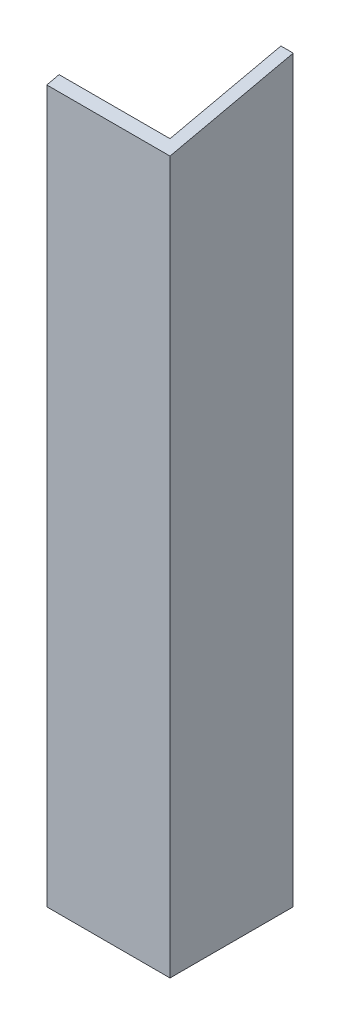
ISO-10303-21;
HEADER;
FILE_DESCRIPTION(('STEP AP214'),'2;1');
FILE_NAME('part.step','',(''),(''),'','','');
FILE_SCHEMA(('AUTOMOTIVE_DESIGN { 1 0 10303 214 1 1 1 1 }'));
ENDSEC;
DATA;
#1=APPLICATION_CONTEXT('core data for automotive mechanical design processes');
#2=APPLICATION_PROTOCOL_DEFINITION('international standard','automotive_design',2000,#1);
#3=PRODUCT_CONTEXT('',#1,'mechanical');
#4=PRODUCT('Part','Part','',(#3));
#5=PRODUCT_RELATED_PRODUCT_CATEGORY('part','',(#4));
#6=PRODUCT_DEFINITION_FORMATION('','',#4);
#7=PRODUCT_DEFINITION_CONTEXT('part definition',#1,'design');
#8=PRODUCT_DEFINITION('design','',#6,#7);
#9=PRODUCT_DEFINITION_SHAPE('','',#8);
#10=(LENGTH_UNIT() NAMED_UNIT(*) SI_UNIT(.MILLI.,.METRE.));
#11=(NAMED_UNIT(*) PLANE_ANGLE_UNIT() SI_UNIT($,.RADIAN.));
#12=(NAMED_UNIT(*) SI_UNIT($,.STERADIAN.) SOLID_ANGLE_UNIT());
#13=UNCERTAINTY_MEASURE_WITH_UNIT(LENGTH_MEASURE(1.E-05),#10,'distance_accuracy_value','');
#14=(GEOMETRIC_REPRESENTATION_CONTEXT(3) GLOBAL_UNCERTAINTY_ASSIGNED_CONTEXT((#13)) GLOBAL_UNIT_ASSIGNED_CONTEXT((#10,
#11,#12)) REPRESENTATION_CONTEXT('',''));
#15=CARTESIAN_POINT('',(0.,0.,0.));
#16=DIRECTION('',(0.,0.,1.));
#17=DIRECTION('',(1.,0.,0.));
#18=AXIS2_PLACEMENT_3D('',#15,#16,#17);
#19=CARTESIAN_POINT('',(-3.22727272727272,4.20454545454545,-20.));
#20=DIRECTION('',(-1.,0.,0.));
#21=DIRECTION('',(0.,-1.,0.));
#22=AXIS2_PLACEMENT_3D('',#19,#20,#21);
#23=PLANE('',#22);
#24=DIRECTION('',(0.,-1.,0.));
#25=VECTOR('',#24,1.);
#26=CARTESIAN_POINT('',(-3.22727272727271,4.20454545454545,-2.));
#27=LINE('',#26,#25);
#28=CARTESIAN_POINT('',(-3.22727272727272,0.181068762396736,-1.99999999999999));
#29=VERTEX_POINT('',#28);
#30=CARTESIAN_POINT('',(-3.22727272727271,-115.795454545455,-2.));
#31=VERTEX_POINT('',#30);
#32=EDGE_CURVE('E71',#29,#31,#27,.T.);
#33=ORIENTED_EDGE('',*,*,#32,.T.);
#34=DIRECTION('',(0.,0.,1.));
#35=VECTOR('',#34,1.);
#36=CARTESIAN_POINT('',(-3.22727272727271,-115.795454545455,-20.));
#37=LINE('',#36,#35);
#38=CARTESIAN_POINT('',(-3.22727272727271,-115.795454545455,0.));
#39=VERTEX_POINT('',#38);
#40=EDGE_CURVE('E127',#31,#39,#37,.T.);
#41=ORIENTED_EDGE('',*,*,#40,.T.);
#42=DIRECTION('',(0.,-1.,0.));
#43=VECTOR('',#42,1.);
#44=CARTESIAN_POINT('',(-3.22727272727272,4.20454545454545,0.));
#45=LINE('',#44,#43);
#46=CARTESIAN_POINT('',(-3.22727272727272,-0.265984203397564,0.));
#47=VERTEX_POINT('',#46);
#48=EDGE_CURVE('E135',#47,#39,#45,.T.);
#49=ORIENTED_EDGE('',*,*,#48,.F.);
#50=DIRECTION('',(0.,-0.218143241396544,0.975916761938747));
#51=VECTOR('',#50,1.);
#52=CARTESIAN_POINT('',(-3.22727272727272,4.20454545454545,-20.));
#53=LINE('',#52,#51);
#54=EDGE_CURVE('E78',#29,#47,#53,.T.);
#55=ORIENTED_EDGE('',*,*,#54,.F.);
#56=EDGE_LOOP('',(#33,#41,#49,#55));
#57=FACE_BOUND('',#56,.T.);
#58=ADVANCED_FACE('F57',(#57),#23,.T.);
#59=CARTESIAN_POINT('',(16.7727272727273,4.20454545454545,-20.));
#60=DIRECTION('',(1.,0.,0.));
#61=DIRECTION('',(0.,1.,0.));
#62=AXIS2_PLACEMENT_3D('',#59,#60,#61);
#63=PLANE('',#62);
#64=DIRECTION('',(0.,-0.218143241396544,0.975916761938747));
#65=VECTOR('',#64,1.);
#66=CARTESIAN_POINT('',(16.7727272727273,4.20454545454545,-20.));
#67=LINE('',#66,#65);
#68=CARTESIAN_POINT('',(16.7727272727273,4.20454545454545,-20.));
#69=VERTEX_POINT('',#68);
#70=CARTESIAN_POINT('',(16.7727272727273,-0.265984203397561,0.));
#71=VERTEX_POINT('',#70);
#72=EDGE_CURVE('E125',#69,#71,#67,.T.);
#73=ORIENTED_EDGE('',*,*,#72,.T.);
#74=DIRECTION('',(0.,1.,0.));
#75=VECTOR('',#74,1.);
#76=CARTESIAN_POINT('',(16.7727272727273,4.20454545454545,0.));
#77=LINE('',#76,#75);
#78=CARTESIAN_POINT('',(16.7727272727273,-115.795454545455,0.));
#79=VERTEX_POINT('',#78);
#80=EDGE_CURVE('E142',#79,#71,#77,.T.);
#81=ORIENTED_EDGE('',*,*,#80,.F.);
#82=DIRECTION('',(0.,0.,1.));
#83=VECTOR('',#82,1.);
#84=CARTESIAN_POINT('',(16.7727272727273,-115.795454545455,-20.));
#85=LINE('',#84,#83);
#86=CARTESIAN_POINT('',(16.7727272727273,-115.795454545455,-20.));
#87=VERTEX_POINT('',#86);
#88=EDGE_CURVE('E130',#87,#79,#85,.T.);
#89=ORIENTED_EDGE('',*,*,#88,.F.);
#90=DIRECTION('',(0.,1.,0.));
#91=VECTOR('',#90,1.);
#92=CARTESIAN_POINT('',(16.7727272727273,4.20454545454545,-20.));
#93=LINE('',#92,#91);
#94=EDGE_CURVE('E128',#87,#69,#93,.T.);
#95=ORIENTED_EDGE('',*,*,#94,.T.);
#96=EDGE_LOOP('',(#73,#81,#89,#95));
#97=FACE_BOUND('',#96,.T.);
#98=ADVANCED_FACE('F160',(#97),#63,.T.);
#99=CARTESIAN_POINT('',(-3.22727272727271,-115.795454545455,-20.));
#100=DIRECTION('',(0.,-1.,0.));
#101=DIRECTION('',(0.,0.,-1.));
#102=AXIS2_PLACEMENT_3D('',#99,#100,#101);
#103=PLANE('',#102);
#104=DIRECTION('',(0.,0.,1.));
#105=VECTOR('',#104,1.);
#106=CARTESIAN_POINT('',(14.7727272727273,-115.795454545455,0.));
#107=LINE('',#106,#105);
#108=CARTESIAN_POINT('',(14.7727272727273,-115.795454545455,-20.));
#109=VERTEX_POINT('',#108);
#110=CARTESIAN_POINT('',(14.7727272727273,-115.795454545455,-2.));
#111=VERTEX_POINT('',#110);
#112=EDGE_CURVE('E158',#109,#111,#107,.T.);
#113=ORIENTED_EDGE('',*,*,#112,.F.);
#114=DIRECTION('',(1.,0.,0.));
#115=VECTOR('',#114,1.);
#116=CARTESIAN_POINT('',(-3.22727272727271,-115.795454545455,-20.));
#117=LINE('',#116,#115);
#118=EDGE_CURVE('E121',#109,#87,#117,.T.);
#119=ORIENTED_EDGE('',*,*,#118,.T.);
#120=ORIENTED_EDGE('',*,*,#88,.T.);
#121=DIRECTION('',(1.,0.,0.));
#122=VECTOR('',#121,1.);
#123=CARTESIAN_POINT('',(-3.22727272727271,-115.795454545455,0.));
#124=LINE('',#123,#122);
#125=EDGE_CURVE('E138',#39,#79,#124,.T.);
#126=ORIENTED_EDGE('',*,*,#125,.F.);
#127=ORIENTED_EDGE('',*,*,#40,.F.);
#128=DIRECTION('',(-1.,0.,0.));
#129=VECTOR('',#128,1.);
#130=CARTESIAN_POINT('',(0.,-115.795454545455,-2.));
#131=LINE('',#130,#129);
#132=EDGE_CURVE('E163',#111,#31,#131,.T.);
#133=ORIENTED_EDGE('',*,*,#132,.F.);
#134=EDGE_LOOP('',(#113,#119,#120,#126,#127,#133));
#135=FACE_BOUND('',#134,.T.);
#136=ADVANCED_FACE('F154',(#135),#103,.T.);
#137=CARTESIAN_POINT('',(0.,0.,-20.));
#138=DIRECTION('',(0.,0.,1.));
#139=DIRECTION('',(1.,0.,0.));
#140=AXIS2_PLACEMENT_3D('',#137,#138,#139);
#141=PLANE('',#140);
#142=ORIENTED_EDGE('',*,*,#118,.F.);
#143=DIRECTION('',(0.,-1.,0.));
#144=VECTOR('',#143,1.);
#145=CARTESIAN_POINT('',(14.7727272727273,4.20454545454545,-20.));
#146=LINE('',#145,#144);
#147=CARTESIAN_POINT('',(14.7727272727273,4.20454545454545,-20.));
#148=VERTEX_POINT('',#147);
#149=EDGE_CURVE('E111',#148,#109,#146,.T.);
#150=ORIENTED_EDGE('',*,*,#149,.F.);
#151=DIRECTION('',(-1.,0.,0.));
#152=VECTOR('',#151,1.);
#153=CARTESIAN_POINT('',(-3.22727272727272,4.20454545454545,-20.));
#154=LINE('',#153,#152);
#155=EDGE_CURVE('E120',#69,#148,#154,.T.);
#156=ORIENTED_EDGE('',*,*,#155,.F.);
#157=ORIENTED_EDGE('',*,*,#94,.F.);
#158=EDGE_LOOP('',(#142,#150,#156,#157));
#159=FACE_BOUND('',#158,.T.);
#160=ADVANCED_FACE('F118',(#159),#141,.F.);
#161=CARTESIAN_POINT('',(0.,0.,0.));
#162=DIRECTION('',(0.,0.,1.));
#163=DIRECTION('',(1.,0.,0.));
#164=AXIS2_PLACEMENT_3D('',#161,#162,#163);
#165=PLANE('',#164);
#166=DIRECTION('',(-1.,0.,0.));
#167=VECTOR('',#166,1.);
#168=CARTESIAN_POINT('',(16.7727272727273,-0.265984203397561,0.));
#169=LINE('',#168,#167);
#170=EDGE_CURVE('E139',#71,#47,#169,.T.);
#171=ORIENTED_EDGE('',*,*,#170,.T.);
#172=ORIENTED_EDGE('',*,*,#48,.T.);
#173=ORIENTED_EDGE('',*,*,#125,.T.);
#174=ORIENTED_EDGE('',*,*,#80,.T.);
#175=EDGE_LOOP('',(#171,#172,#173,#174));
#176=FACE_BOUND('',#175,.T.);
#177=ADVANCED_FACE('F162',(#176),#165,.T.);
#178=CARTESIAN_POINT('',(16.7727272727273,4.20454545454545,-20.));
#179=DIRECTION('',(0.,-0.975916761938747,-0.218143241396544));
#180=DIRECTION('',(0.,0.218143241396544,-0.975916761938747));
#181=AXIS2_PLACEMENT_3D('',#178,#179,#180);
#182=PLANE('',#181);
#183=ORIENTED_EDGE('',*,*,#155,.T.);
#184=DIRECTION('',(0.,-0.218143241396544,0.975916761938747));
#185=VECTOR('',#184,1.);
#186=CARTESIAN_POINT('',(14.7727272727273,4.20454545454545,-20.));
#187=LINE('',#186,#185);
#188=CARTESIAN_POINT('',(14.7727272727273,0.181068762396738,-2.));
#189=VERTEX_POINT('',#188);
#190=EDGE_CURVE('E12',#148,#189,#187,.T.);
#191=ORIENTED_EDGE('',*,*,#190,.T.);
#192=DIRECTION('',(-1.,0.,0.));
#193=VECTOR('',#192,1.);
#194=CARTESIAN_POINT('',(16.7727272727273,0.18106876239674,-2.));
#195=LINE('',#194,#193);
#196=EDGE_CURVE('E64',#189,#29,#195,.T.);
#197=ORIENTED_EDGE('',*,*,#196,.T.);
#198=ORIENTED_EDGE('',*,*,#54,.T.);
#199=ORIENTED_EDGE('',*,*,#170,.F.);
#200=ORIENTED_EDGE('',*,*,#72,.F.);
#201=EDGE_LOOP('',(#183,#191,#197,#198,#199,#200));
#202=FACE_BOUND('',#201,.T.);
#203=ADVANCED_FACE('F123',(#202),#182,.F.);
#204=CARTESIAN_POINT('',(14.7727272727273,4.20454545454545,0.));
#205=DIRECTION('',(1.,0.,0.));
#206=DIRECTION('',(0.,0.,-1.));
#207=AXIS2_PLACEMENT_3D('',#204,#205,#206);
#208=PLANE('',#207);
#209=ORIENTED_EDGE('',*,*,#149,.T.);
#210=ORIENTED_EDGE('',*,*,#112,.T.);
#211=DIRECTION('',(0.,-1.,0.));
#212=VECTOR('',#211,1.);
#213=CARTESIAN_POINT('',(14.7727272727273,4.20454545454545,-2.));
#214=LINE('',#213,#212);
#215=EDGE_CURVE('E113',#189,#111,#214,.T.);
#216=ORIENTED_EDGE('',*,*,#215,.F.);
#217=ORIENTED_EDGE('',*,*,#190,.F.);
#218=EDGE_LOOP('',(#209,#210,#216,#217));
#219=FACE_BOUND('',#218,.T.);
#220=ADVANCED_FACE('F109',(#219),#208,.F.);
#221=CARTESIAN_POINT('',(0.,4.20454545454545,-2.));
#222=DIRECTION('',(0.,0.,1.));
#223=DIRECTION('',(1.,0.,0.));
#224=AXIS2_PLACEMENT_3D('',#221,#222,#223);
#225=PLANE('',#224);
#226=ORIENTED_EDGE('',*,*,#215,.T.);
#227=ORIENTED_EDGE('',*,*,#132,.T.);
#228=ORIENTED_EDGE('',*,*,#32,.F.);
#229=ORIENTED_EDGE('',*,*,#196,.F.);
#230=EDGE_LOOP('',(#226,#227,#228,#229));
#231=FACE_BOUND('',#230,.T.);
#232=ADVANCED_FACE('F167',(#231),#225,.F.);
#233=CLOSED_SHELL('',(#58,#98,#136,#160,#177,#203,#220,#232));
#234=MANIFOLD_SOLID_BREP('B2',#233);
#235=ADVANCED_BREP_SHAPE_REPRESENTATION('',(#18,#234),#14);
#236=SHAPE_DEFINITION_REPRESENTATION(#9,#235);
ENDSEC;
END-ISO-10303-21;
